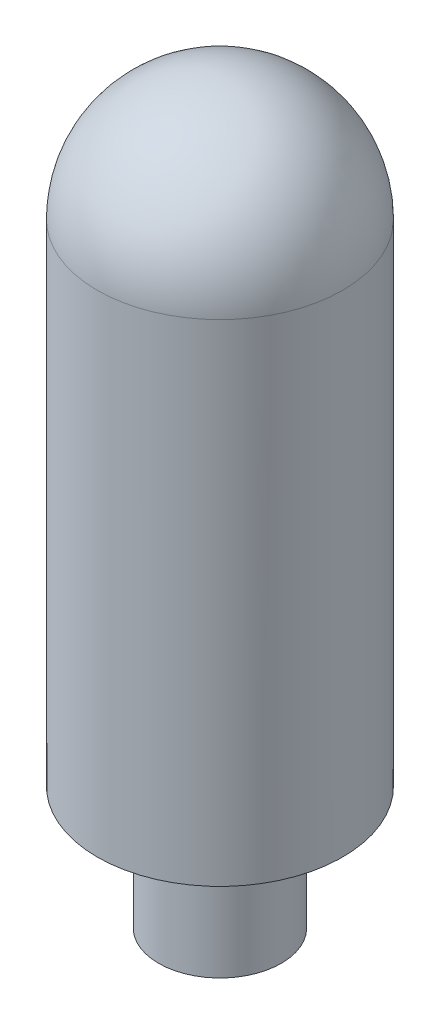
ISO-10303-21;
HEADER;
FILE_DESCRIPTION(('STEP AP214'),'2;1');
FILE_NAME('part.step','',(''),(''),'','','');
FILE_SCHEMA(('AUTOMOTIVE_DESIGN { 1 0 10303 214 1 1 1 1 }'));
ENDSEC;
DATA;
#1=APPLICATION_CONTEXT('core data for automotive mechanical design processes');
#2=APPLICATION_PROTOCOL_DEFINITION('international standard','automotive_design',2000,#1);
#3=PRODUCT_CONTEXT('',#1,'mechanical');
#4=PRODUCT('Part','Part','',(#3));
#5=PRODUCT_RELATED_PRODUCT_CATEGORY('part','',(#4));
#6=PRODUCT_DEFINITION_FORMATION('','',#4);
#7=PRODUCT_DEFINITION_CONTEXT('part definition',#1,'design');
#8=PRODUCT_DEFINITION('design','',#6,#7);
#9=PRODUCT_DEFINITION_SHAPE('','',#8);
#10=(LENGTH_UNIT() NAMED_UNIT(*) SI_UNIT(.MILLI.,.METRE.));
#11=(NAMED_UNIT(*) PLANE_ANGLE_UNIT() SI_UNIT($,.RADIAN.));
#12=(NAMED_UNIT(*) SI_UNIT($,.STERADIAN.) SOLID_ANGLE_UNIT());
#13=UNCERTAINTY_MEASURE_WITH_UNIT(LENGTH_MEASURE(1.E-05),#10,'distance_accuracy_value','');
#14=(GEOMETRIC_REPRESENTATION_CONTEXT(3) GLOBAL_UNCERTAINTY_ASSIGNED_CONTEXT((#13)) GLOBAL_UNIT_ASSIGNED_CONTEXT((#10,
#11,#12)) REPRESENTATION_CONTEXT('',''));
#15=CARTESIAN_POINT('',(0.,0.,0.));
#16=DIRECTION('',(0.,0.,1.));
#17=DIRECTION('',(1.,0.,0.));
#18=AXIS2_PLACEMENT_3D('',#15,#16,#17);
#19=CARTESIAN_POINT('',(0.,0.,0.));
#20=DIRECTION('',(0.,1.,0.));
#21=DIRECTION('',(0.,0.,1.));
#22=AXIS2_PLACEMENT_3D('',#19,#20,#21);
#23=PLANE('',#22);
#24=CARTESIAN_POINT('',(0.,0.,0.));
#25=DIRECTION('',(0.,1.,0.));
#26=DIRECTION('',(0.,0.,1.));
#27=AXIS2_PLACEMENT_3D('',#24,#25,#26);
#28=CIRCLE('',#27,2.);
#29=CARTESIAN_POINT('',(0.,0.,2.));
#30=VERTEX_POINT('',#29);
#31=EDGE_CURVE('E10',#30,#30,#28,.T.);
#32=ORIENTED_EDGE('',*,*,#31,.F.);
#33=EDGE_LOOP('',(#32));
#34=FACE_BOUND('',#33,.T.);
#35=ADVANCED_FACE('F30',(#34),#23,.F.);
#36=CARTESIAN_POINT('',(0.,34.2935408026971,0.));
#37=DIRECTION('',(0.,1.,0.));
#38=DIRECTION('',(0.,0.,1.));
#39=AXIS2_PLACEMENT_3D('',#36,#37,#38);
#40=CYLINDRICAL_SURFACE('',#39,2.);
#41=CARTESIAN_POINT('',(0.,4.,0.));
#42=DIRECTION('',(0.,1.,0.));
#43=DIRECTION('',(0.,0.,1.));
#44=AXIS2_PLACEMENT_3D('',#41,#42,#43);
#45=CIRCLE('',#44,2.);
#46=CARTESIAN_POINT('',(0.,4.,2.));
#47=VERTEX_POINT('',#46);
#48=EDGE_CURVE('E36',#47,#47,#45,.T.);
#49=ORIENTED_EDGE('',*,*,#48,.F.);
#50=EDGE_LOOP('',(#49));
#51=FACE_BOUND('',#50,.T.);
#52=ORIENTED_EDGE('',*,*,#31,.T.);
#53=EDGE_LOOP('',(#52));
#54=FACE_BOUND('',#53,.T.);
#55=ADVANCED_FACE('F60',(#51,#54),#40,.T.);
#56=CARTESIAN_POINT('',(2.,4.,0.));
#57=DIRECTION('',(0.,1.,0.));
#58=DIRECTION('',(0.,0.,1.));
#59=AXIS2_PLACEMENT_3D('',#56,#57,#58);
#60=PLANE('',#59);
#61=CARTESIAN_POINT('',(0.,4.,0.));
#62=DIRECTION('',(0.,1.,0.));
#63=DIRECTION('',(0.,0.,1.));
#64=AXIS2_PLACEMENT_3D('',#61,#62,#63);
#65=CIRCLE('',#64,4.);
#66=CARTESIAN_POINT('',(0.,4.,4.));
#67=VERTEX_POINT('',#66);
#68=EDGE_CURVE('E40',#67,#67,#65,.T.);
#69=ORIENTED_EDGE('',*,*,#68,.F.);
#70=EDGE_LOOP('',(#69));
#71=FACE_BOUND('',#70,.T.);
#72=ORIENTED_EDGE('',*,*,#48,.T.);
#73=EDGE_LOOP('',(#72));
#74=FACE_BOUND('',#73,.T.);
#75=ADVANCED_FACE('F55',(#71,#74),#60,.F.);
#76=CARTESIAN_POINT('',(0.,34.2935408026971,0.));
#77=DIRECTION('',(0.,1.,0.));
#78=DIRECTION('',(0.,0.,1.));
#79=AXIS2_PLACEMENT_3D('',#76,#77,#78);
#80=CYLINDRICAL_SURFACE('',#79,4.);
#81=CARTESIAN_POINT('',(0.,20.,0.));
#82=DIRECTION('',(0.,1.,0.));
#83=DIRECTION('',(0.,0.,1.));
#84=AXIS2_PLACEMENT_3D('',#81,#82,#83);
#85=CIRCLE('',#84,4.);
#86=CARTESIAN_POINT('',(0.,20.,4.));
#87=VERTEX_POINT('',#86);
#88=EDGE_CURVE('E44',#87,#87,#85,.T.);
#89=ORIENTED_EDGE('',*,*,#88,.F.);
#90=EDGE_LOOP('',(#89));
#91=FACE_BOUND('',#90,.T.);
#92=ORIENTED_EDGE('',*,*,#68,.T.);
#93=EDGE_LOOP('',(#92));
#94=FACE_BOUND('',#93,.T.);
#95=ADVANCED_FACE('F52',(#91,#94),#80,.T.);
#96=CARTESIAN_POINT('',(0.,20.,0.));
#97=DIRECTION('',(0.,1.,0.));
#98=DIRECTION('',(1.,0.,0.));
#99=AXIS2_PLACEMENT_3D('',#96,#97,#98);
#100=SPHERICAL_SURFACE('',#99,4.);
#101=ORIENTED_EDGE('',*,*,#88,.T.);
#102=EDGE_LOOP('',(#101));
#103=FACE_BOUND('',#102,.T.);
#104=ADVANCED_FACE('F50',(#103),#100,.T.);
#105=CLOSED_SHELL('',(#35,#55,#75,#95,#104));
#106=MANIFOLD_SOLID_BREP('B2',#105);
#107=ADVANCED_BREP_SHAPE_REPRESENTATION('',(#18,#106),#14);
#108=SHAPE_DEFINITION_REPRESENTATION(#9,#107);
ENDSEC;
END-ISO-10303-21;
